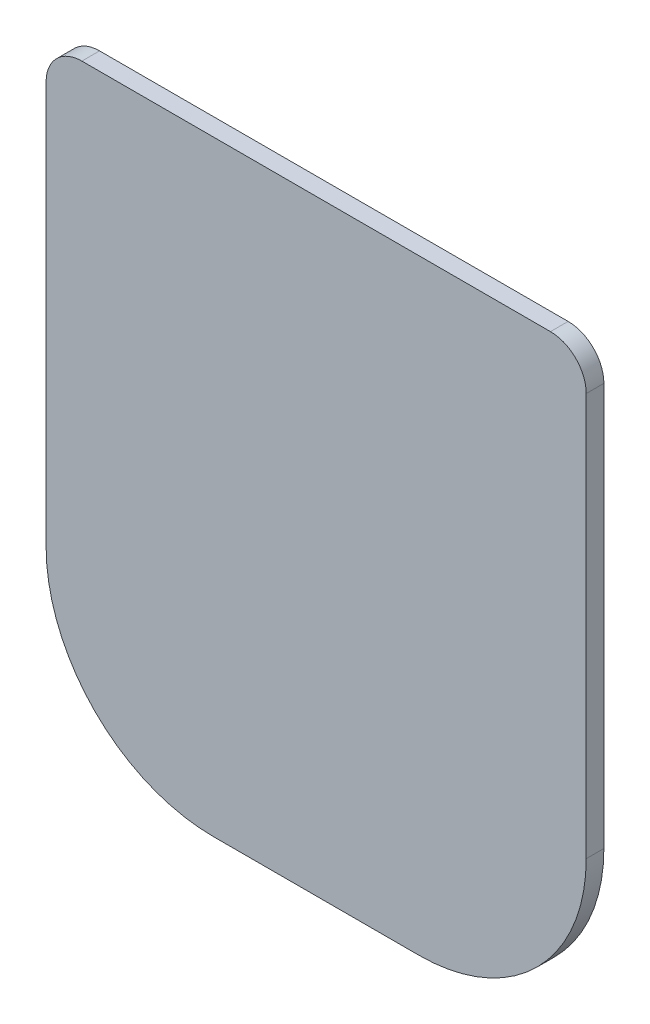
ISO-10303-21;
HEADER;
FILE_DESCRIPTION(('STEP AP214'),'2;1');
FILE_NAME('part.step','',(''),(''),'','','');
FILE_SCHEMA(('AUTOMOTIVE_DESIGN { 1 0 10303 214 1 1 1 1 }'));
ENDSEC;
DATA;
#1=APPLICATION_CONTEXT('core data for automotive mechanical design processes');
#2=APPLICATION_PROTOCOL_DEFINITION('international standard','automotive_design',2000,#1);
#3=PRODUCT_CONTEXT('',#1,'mechanical');
#4=PRODUCT('Part','Part','',(#3));
#5=PRODUCT_RELATED_PRODUCT_CATEGORY('part','',(#4));
#6=PRODUCT_DEFINITION_FORMATION('','',#4);
#7=PRODUCT_DEFINITION_CONTEXT('part definition',#1,'design');
#8=PRODUCT_DEFINITION('design','',#6,#7);
#9=PRODUCT_DEFINITION_SHAPE('','',#8);
#10=(LENGTH_UNIT() NAMED_UNIT(*) SI_UNIT(.MILLI.,.METRE.));
#11=(NAMED_UNIT(*) PLANE_ANGLE_UNIT() SI_UNIT($,.RADIAN.));
#12=(NAMED_UNIT(*) SI_UNIT($,.STERADIAN.) SOLID_ANGLE_UNIT());
#13=UNCERTAINTY_MEASURE_WITH_UNIT(LENGTH_MEASURE(1.E-05),#10,'distance_accuracy_value','');
#14=(GEOMETRIC_REPRESENTATION_CONTEXT(3) GLOBAL_UNCERTAINTY_ASSIGNED_CONTEXT((#13)) GLOBAL_UNIT_ASSIGNED_CONTEXT((#10,
#11,#12)) REPRESENTATION_CONTEXT('',''));
#15=CARTESIAN_POINT('',(0.,0.,0.));
#16=DIRECTION('',(0.,0.,1.));
#17=DIRECTION('',(1.,0.,0.));
#18=AXIS2_PLACEMENT_3D('',#15,#16,#17);
#19=CARTESIAN_POINT('',(-57.,58.81,4.3));
#20=DIRECTION('',(0.,0.,-1.));
#21=DIRECTION('',(-1.,0.,0.));
#22=AXIS2_PLACEMENT_3D('',#19,#20,#21);
#23=CYLINDRICAL_SURFACE('',#22,8.7);
#24=CARTESIAN_POINT('',(-57.,58.81,0.));
#25=DIRECTION('',(0.,0.,1.));
#26=DIRECTION('',(-1.,0.,0.));
#27=AXIS2_PLACEMENT_3D('',#24,#25,#26);
#28=CIRCLE('',#27,8.7);
#29=CARTESIAN_POINT('',(-57.,67.51,0.));
#30=VERTEX_POINT('',#29);
#31=CARTESIAN_POINT('',(-65.7,58.81,0.));
#32=VERTEX_POINT('',#31);
#33=EDGE_CURVE('E132',#30,#32,#28,.T.);
#34=ORIENTED_EDGE('',*,*,#33,.T.);
#35=DIRECTION('',(0.,0.,-1.));
#36=VECTOR('',#35,1.);
#37=CARTESIAN_POINT('',(-65.7,58.81,4.3));
#38=LINE('',#37,#36);
#39=CARTESIAN_POINT('',(-65.7,58.81,4.3));
#40=VERTEX_POINT('',#39);
#41=EDGE_CURVE('E11',#40,#32,#38,.T.);
#42=ORIENTED_EDGE('',*,*,#41,.F.);
#43=CARTESIAN_POINT('',(-57.,58.81,4.3));
#44=DIRECTION('',(0.,0.,1.));
#45=DIRECTION('',(-1.,0.,0.));
#46=AXIS2_PLACEMENT_3D('',#43,#44,#45);
#47=CIRCLE('',#46,8.7);
#48=CARTESIAN_POINT('',(-57.,67.51,4.3));
#49=VERTEX_POINT('',#48);
#50=EDGE_CURVE('E147',#49,#40,#47,.T.);
#51=ORIENTED_EDGE('',*,*,#50,.F.);
#52=DIRECTION('',(0.,0.,-1.));
#53=VECTOR('',#52,1.);
#54=CARTESIAN_POINT('',(-57.,67.51,4.3));
#55=LINE('',#54,#53);
#56=EDGE_CURVE('E128',#49,#30,#55,.T.);
#57=ORIENTED_EDGE('',*,*,#56,.T.);
#58=EDGE_LOOP('',(#34,#42,#51,#57));
#59=FACE_BOUND('',#58,.T.);
#60=ADVANCED_FACE('F36',(#59),#23,.T.);
#61=CARTESIAN_POINT('',(-65.7,58.81,4.3));
#62=DIRECTION('',(1.,0.,0.));
#63=DIRECTION('',(0.,1.,0.));
#64=AXIS2_PLACEMENT_3D('',#61,#62,#63);
#65=PLANE('',#64);
#66=DIRECTION('',(0.,-1.,0.));
#67=VECTOR('',#66,1.);
#68=CARTESIAN_POINT('',(-65.7,58.81,0.));
#69=LINE('',#68,#67);
#70=CARTESIAN_POINT('',(-65.7,-39.19,0.));
#71=VERTEX_POINT('',#70);
#72=EDGE_CURVE('E135',#32,#71,#69,.T.);
#73=ORIENTED_EDGE('',*,*,#72,.T.);
#74=DIRECTION('',(0.,0.,-1.));
#75=VECTOR('',#74,1.);
#76=CARTESIAN_POINT('',(-65.7,-39.19,4.3));
#77=LINE('',#76,#75);
#78=CARTESIAN_POINT('',(-65.7,-39.19,4.3));
#79=VERTEX_POINT('',#78);
#80=EDGE_CURVE('E44',#79,#71,#77,.T.);
#81=ORIENTED_EDGE('',*,*,#80,.F.);
#82=DIRECTION('',(0.,-1.,0.));
#83=VECTOR('',#82,1.);
#84=CARTESIAN_POINT('',(-65.7,58.81,4.3));
#85=LINE('',#84,#83);
#86=EDGE_CURVE('E95',#40,#79,#85,.T.);
#87=ORIENTED_EDGE('',*,*,#86,.F.);
#88=ORIENTED_EDGE('',*,*,#41,.T.);
#89=EDGE_LOOP('',(#73,#81,#87,#88));
#90=FACE_BOUND('',#89,.T.);
#91=ADVANCED_FACE('F181',(#90),#65,.F.);
#92=CARTESIAN_POINT('',(-25.,-39.19,4.3));
#93=DIRECTION('',(0.,0.,-1.));
#94=DIRECTION('',(-1.,0.,0.));
#95=AXIS2_PLACEMENT_3D('',#92,#93,#94);
#96=CYLINDRICAL_SURFACE('',#95,40.7);
#97=CARTESIAN_POINT('',(-25.,-39.19,0.));
#98=DIRECTION('',(0.,0.,1.));
#99=DIRECTION('',(1.,0.,0.));
#100=AXIS2_PLACEMENT_3D('',#97,#98,#99);
#101=CIRCLE('',#100,40.7);
#102=CARTESIAN_POINT('',(-25.,-79.89,0.));
#103=VERTEX_POINT('',#102);
#104=EDGE_CURVE('E137',#71,#103,#101,.T.);
#105=ORIENTED_EDGE('',*,*,#104,.T.);
#106=DIRECTION('',(0.,0.,-1.));
#107=VECTOR('',#106,1.);
#108=CARTESIAN_POINT('',(-25.,-79.89,4.3));
#109=LINE('',#108,#107);
#110=CARTESIAN_POINT('',(-25.,-79.89,4.3));
#111=VERTEX_POINT('',#110);
#112=EDGE_CURVE('E154',#111,#103,#109,.T.);
#113=ORIENTED_EDGE('',*,*,#112,.F.);
#114=CARTESIAN_POINT('',(-25.,-39.19,4.3));
#115=DIRECTION('',(0.,0.,1.));
#116=DIRECTION('',(1.,0.,0.));
#117=AXIS2_PLACEMENT_3D('',#114,#115,#116);
#118=CIRCLE('',#117,40.7);
#119=EDGE_CURVE('E162',#79,#111,#118,.T.);
#120=ORIENTED_EDGE('',*,*,#119,.F.);
#121=ORIENTED_EDGE('',*,*,#80,.T.);
#122=EDGE_LOOP('',(#105,#113,#120,#121));
#123=FACE_BOUND('',#122,.T.);
#124=ADVANCED_FACE('F160',(#123),#96,.T.);
#125=CARTESIAN_POINT('',(0.49999999999999,-79.89,4.3));
#126=DIRECTION('',(0.,1.,0.));
#127=DIRECTION('',(0.,0.,1.));
#128=AXIS2_PLACEMENT_3D('',#125,#126,#127);
#129=PLANE('',#128);
#130=DIRECTION('',(1.,0.,0.));
#131=VECTOR('',#130,1.);
#132=CARTESIAN_POINT('',(0.49999999999999,-79.89,0.));
#133=LINE('',#132,#131);
#134=CARTESIAN_POINT('',(25.,-79.89,0.));
#135=VERTEX_POINT('',#134);
#136=EDGE_CURVE('E140',#103,#135,#133,.T.);
#137=ORIENTED_EDGE('',*,*,#136,.T.);
#138=DIRECTION('',(0.,0.,-1.));
#139=VECTOR('',#138,1.);
#140=CARTESIAN_POINT('',(25.,-79.89,4.3));
#141=LINE('',#140,#139);
#142=CARTESIAN_POINT('',(25.,-79.89,4.3));
#143=VERTEX_POINT('',#142);
#144=EDGE_CURVE('E151',#143,#135,#141,.T.);
#145=ORIENTED_EDGE('',*,*,#144,.F.);
#146=DIRECTION('',(1.,0.,0.));
#147=VECTOR('',#146,1.);
#148=CARTESIAN_POINT('',(-25.,-79.89,4.3));
#149=LINE('',#148,#147);
#150=EDGE_CURVE('E173',#111,#143,#149,.T.);
#151=ORIENTED_EDGE('',*,*,#150,.F.);
#152=ORIENTED_EDGE('',*,*,#112,.T.);
#153=EDGE_LOOP('',(#137,#145,#151,#152));
#154=FACE_BOUND('',#153,.T.);
#155=ADVANCED_FACE('F169',(#154),#129,.F.);
#156=CARTESIAN_POINT('',(25.,-39.19,4.3));
#157=DIRECTION('',(0.,0.,-1.));
#158=DIRECTION('',(-1.,0.,0.));
#159=AXIS2_PLACEMENT_3D('',#156,#157,#158);
#160=CYLINDRICAL_SURFACE('',#159,40.7);
#161=CARTESIAN_POINT('',(25.,-39.19,0.));
#162=DIRECTION('',(0.,0.,1.));
#163=DIRECTION('',(1.,0.,0.));
#164=AXIS2_PLACEMENT_3D('',#161,#162,#163);
#165=CIRCLE('',#164,40.7);
#166=CARTESIAN_POINT('',(65.7,-39.19,0.));
#167=VERTEX_POINT('',#166);
#168=EDGE_CURVE('E142',#135,#167,#165,.T.);
#169=ORIENTED_EDGE('',*,*,#168,.T.);
#170=DIRECTION('',(0.,0.,-1.));
#171=VECTOR('',#170,1.);
#172=CARTESIAN_POINT('',(65.7,-39.19,4.3));
#173=LINE('',#172,#171);
#174=CARTESIAN_POINT('',(65.7,-39.19,4.3));
#175=VERTEX_POINT('',#174);
#176=EDGE_CURVE('E123',#175,#167,#173,.T.);
#177=ORIENTED_EDGE('',*,*,#176,.F.);
#178=CARTESIAN_POINT('',(25.,-39.19,4.3));
#179=DIRECTION('',(0.,0.,1.));
#180=DIRECTION('',(1.,0.,0.));
#181=AXIS2_PLACEMENT_3D('',#178,#179,#180);
#182=CIRCLE('',#181,40.7);
#183=EDGE_CURVE('E114',#143,#175,#182,.T.);
#184=ORIENTED_EDGE('',*,*,#183,.F.);
#185=ORIENTED_EDGE('',*,*,#144,.T.);
#186=EDGE_LOOP('',(#169,#177,#184,#185));
#187=FACE_BOUND('',#186,.T.);
#188=ADVANCED_FACE('F172',(#187),#160,.T.);
#189=CARTESIAN_POINT('',(65.7,-39.19,4.3));
#190=DIRECTION('',(-1.,0.,0.));
#191=DIRECTION('',(0.,0.,1.));
#192=AXIS2_PLACEMENT_3D('',#189,#190,#191);
#193=PLANE('',#192);
#194=DIRECTION('',(0.,1.,0.));
#195=VECTOR('',#194,1.);
#196=CARTESIAN_POINT('',(65.7,-39.19,0.));
#197=LINE('',#196,#195);
#198=CARTESIAN_POINT('',(65.7,58.81,0.));
#199=VERTEX_POINT('',#198);
#200=EDGE_CURVE('E122',#167,#199,#197,.T.);
#201=ORIENTED_EDGE('',*,*,#200,.T.);
#202=DIRECTION('',(0.,0.,-1.));
#203=VECTOR('',#202,1.);
#204=CARTESIAN_POINT('',(65.7,58.81,4.3));
#205=LINE('',#204,#203);
#206=CARTESIAN_POINT('',(65.7,58.81,4.3));
#207=VERTEX_POINT('',#206);
#208=EDGE_CURVE('E119',#207,#199,#205,.T.);
#209=ORIENTED_EDGE('',*,*,#208,.F.);
#210=DIRECTION('',(0.,1.,0.));
#211=VECTOR('',#210,1.);
#212=CARTESIAN_POINT('',(65.7,-39.19,4.3));
#213=LINE('',#212,#211);
#214=EDGE_CURVE('E108',#175,#207,#213,.T.);
#215=ORIENTED_EDGE('',*,*,#214,.F.);
#216=ORIENTED_EDGE('',*,*,#176,.T.);
#217=EDGE_LOOP('',(#201,#209,#215,#216));
#218=FACE_BOUND('',#217,.T.);
#219=ADVANCED_FACE('F120',(#218),#193,.F.);
#220=CARTESIAN_POINT('',(57.,58.81,4.3));
#221=DIRECTION('',(0.,0.,-1.));
#222=DIRECTION('',(-1.,0.,0.));
#223=AXIS2_PLACEMENT_3D('',#220,#221,#222);
#224=CYLINDRICAL_SURFACE('',#223,8.7);
#225=CARTESIAN_POINT('',(57.,58.81,0.));
#226=DIRECTION('',(0.,0.,1.));
#227=DIRECTION('',(1.,0.,0.));
#228=AXIS2_PLACEMENT_3D('',#225,#226,#227);
#229=CIRCLE('',#228,8.7);
#230=CARTESIAN_POINT('',(57.,67.51,0.));
#231=VERTEX_POINT('',#230);
#232=EDGE_CURVE('E81',#199,#231,#229,.T.);
#233=ORIENTED_EDGE('',*,*,#232,.T.);
#234=DIRECTION('',(0.,0.,-1.));
#235=VECTOR('',#234,1.);
#236=CARTESIAN_POINT('',(57.,67.51,4.3));
#237=LINE('',#236,#235);
#238=CARTESIAN_POINT('',(57.,67.51,4.3));
#239=VERTEX_POINT('',#238);
#240=EDGE_CURVE('E124',#239,#231,#237,.T.);
#241=ORIENTED_EDGE('',*,*,#240,.F.);
#242=CARTESIAN_POINT('',(57.,58.81,4.3));
#243=DIRECTION('',(0.,0.,1.));
#244=DIRECTION('',(1.,0.,0.));
#245=AXIS2_PLACEMENT_3D('',#242,#243,#244);
#246=CIRCLE('',#245,8.7);
#247=EDGE_CURVE('E112',#207,#239,#246,.T.);
#248=ORIENTED_EDGE('',*,*,#247,.F.);
#249=ORIENTED_EDGE('',*,*,#208,.T.);
#250=EDGE_LOOP('',(#233,#241,#248,#249));
#251=FACE_BOUND('',#250,.T.);
#252=ADVANCED_FACE('F126',(#251),#224,.T.);
#253=CARTESIAN_POINT('',(57.,67.51,4.3));
#254=DIRECTION('',(0.,-1.,0.));
#255=DIRECTION('',(0.,0.,-1.));
#256=AXIS2_PLACEMENT_3D('',#253,#254,#255);
#257=PLANE('',#256);
#258=DIRECTION('',(-1.,0.,0.));
#259=VECTOR('',#258,1.);
#260=CARTESIAN_POINT('',(57.,67.51,0.));
#261=LINE('',#260,#259);
#262=EDGE_CURVE('E87',#231,#30,#261,.T.);
#263=ORIENTED_EDGE('',*,*,#262,.T.);
#264=ORIENTED_EDGE('',*,*,#56,.F.);
#265=DIRECTION('',(-1.,0.,0.));
#266=VECTOR('',#265,1.);
#267=CARTESIAN_POINT('',(57.,67.51,4.3));
#268=LINE('',#267,#266);
#269=EDGE_CURVE('E52',#239,#49,#268,.T.);
#270=ORIENTED_EDGE('',*,*,#269,.F.);
#271=ORIENTED_EDGE('',*,*,#240,.T.);
#272=EDGE_LOOP('',(#263,#264,#270,#271));
#273=FACE_BOUND('',#272,.T.);
#274=ADVANCED_FACE('F197',(#273),#257,.F.);
#275=CARTESIAN_POINT('',(-57.,58.81,4.3));
#276=DIRECTION('',(0.,0.,-1.));
#277=DIRECTION('',(-1.,0.,0.));
#278=AXIS2_PLACEMENT_3D('',#275,#276,#277);
#279=PLANE('',#278);
#280=ORIENTED_EDGE('',*,*,#50,.T.);
#281=ORIENTED_EDGE('',*,*,#86,.T.);
#282=ORIENTED_EDGE('',*,*,#119,.T.);
#283=ORIENTED_EDGE('',*,*,#150,.T.);
#284=ORIENTED_EDGE('',*,*,#183,.T.);
#285=ORIENTED_EDGE('',*,*,#214,.T.);
#286=ORIENTED_EDGE('',*,*,#247,.T.);
#287=ORIENTED_EDGE('',*,*,#269,.T.);
#288=EDGE_LOOP('',(#280,#281,#282,#283,#284,#285,#286,#287));
#289=FACE_BOUND('',#288,.T.);
#290=ADVANCED_FACE('F110',(#289),#279,.F.);
#291=CARTESIAN_POINT('',(-57.,58.81,0.));
#292=DIRECTION('',(0.,0.,-1.));
#293=DIRECTION('',(-1.,0.,0.));
#294=AXIS2_PLACEMENT_3D('',#291,#292,#293);
#295=PLANE('',#294);
#296=ORIENTED_EDGE('',*,*,#33,.F.);
#297=ORIENTED_EDGE('',*,*,#262,.F.);
#298=ORIENTED_EDGE('',*,*,#232,.F.);
#299=ORIENTED_EDGE('',*,*,#200,.F.);
#300=ORIENTED_EDGE('',*,*,#168,.F.);
#301=ORIENTED_EDGE('',*,*,#136,.F.);
#302=ORIENTED_EDGE('',*,*,#104,.F.);
#303=ORIENTED_EDGE('',*,*,#72,.F.);
#304=EDGE_LOOP('',(#296,#297,#298,#299,#300,#301,#302,#303));
#305=FACE_BOUND('',#304,.T.);
#306=ADVANCED_FACE('F165',(#305),#295,.T.);
#307=CLOSED_SHELL('',(#60,#91,#124,#155,#188,#219,#252,#274,#290,#306));
#308=MANIFOLD_SOLID_BREP('B2',#307);
#309=ADVANCED_BREP_SHAPE_REPRESENTATION('',(#18,#308),#14);
#310=SHAPE_DEFINITION_REPRESENTATION(#9,#309);
ENDSEC;
END-ISO-10303-21;
